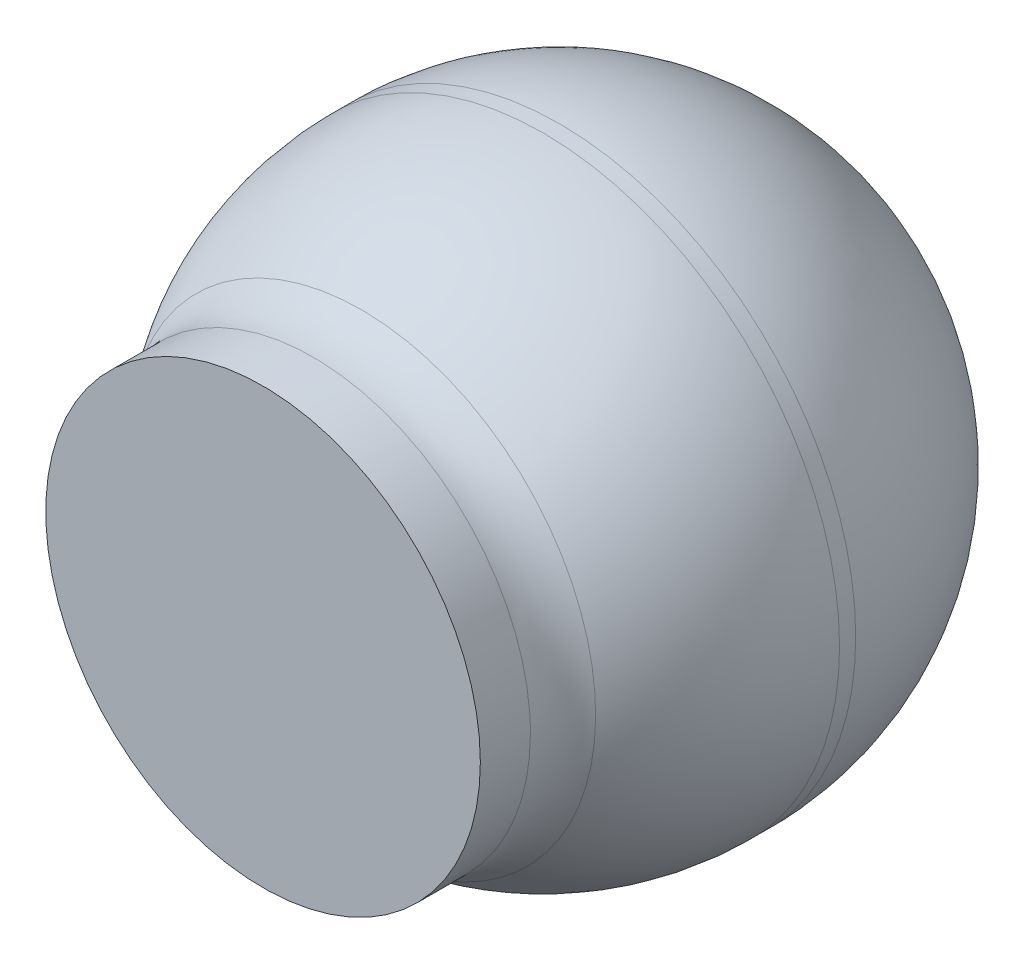
ISO-10303-21;
HEADER;
FILE_DESCRIPTION(('STEP AP214'),'2;1');
FILE_NAME('part.step','',(''),(''),'','','');
FILE_SCHEMA(('AUTOMOTIVE_DESIGN { 1 0 10303 214 1 1 1 1 }'));
ENDSEC;
DATA;
#1=APPLICATION_CONTEXT('core data for automotive mechanical design processes');
#2=APPLICATION_PROTOCOL_DEFINITION('international standard','automotive_design',2000,#1);
#3=PRODUCT_CONTEXT('',#1,'mechanical');
#4=PRODUCT('Part','Part','',(#3));
#5=PRODUCT_RELATED_PRODUCT_CATEGORY('part','',(#4));
#6=PRODUCT_DEFINITION_FORMATION('','',#4);
#7=PRODUCT_DEFINITION_CONTEXT('part definition',#1,'design');
#8=PRODUCT_DEFINITION('design','',#6,#7);
#9=PRODUCT_DEFINITION_SHAPE('','',#8);
#10=(LENGTH_UNIT() NAMED_UNIT(*) SI_UNIT(.MILLI.,.METRE.));
#11=(NAMED_UNIT(*) PLANE_ANGLE_UNIT() SI_UNIT($,.RADIAN.));
#12=(NAMED_UNIT(*) SI_UNIT($,.STERADIAN.) SOLID_ANGLE_UNIT());
#13=UNCERTAINTY_MEASURE_WITH_UNIT(LENGTH_MEASURE(1.E-05),#10,'distance_accuracy_value','');
#14=(GEOMETRIC_REPRESENTATION_CONTEXT(3) GLOBAL_UNCERTAINTY_ASSIGNED_CONTEXT((#13)) GLOBAL_UNIT_ASSIGNED_CONTEXT((#10,
#11,#12)) REPRESENTATION_CONTEXT('',''));
#15=CARTESIAN_POINT('',(0.,0.,0.));
#16=DIRECTION('',(0.,0.,1.));
#17=DIRECTION('',(1.,0.,0.));
#18=AXIS2_PLACEMENT_3D('',#15,#16,#17);
#19=CARTESIAN_POINT('',(0.707080077731,-4.051349291452,10.006534503384));
#20=DIRECTION('',(0.,0.,-1.));
#21=DIRECTION('',(-1.,0.,0.));
#22=AXIS2_PLACEMENT_3D('',#19,#20,#21);
#23=PLANE('',#22);
#24=CARTESIAN_POINT('',(0.707080077731,-4.051349291452,10.006534503384));
#25=DIRECTION('',(0.,0.,1.));
#26=DIRECTION('',(1.,0.,0.));
#27=AXIS2_PLACEMENT_3D('',#24,#25,#26);
#28=CIRCLE('',#27,0.275);
#29=CARTESIAN_POINT('',(0.982080077731,-4.051349291452,10.006534503384));
#30=VERTEX_POINT('',#29);
#31=EDGE_CURVE('E20',#30,#30,#28,.F.);
#32=ORIENTED_EDGE('',*,*,#31,.F.);
#33=EDGE_LOOP('',(#32));
#34=FACE_BOUND('',#33,.T.);
#35=ADVANCED_FACE('F17',(#34),#23,.F.);
#36=CARTESIAN_POINT('',(0.707080077731,-4.051349291452,9.906534503384));
#37=DIRECTION('',(0.,0.,1.));
#38=DIRECTION('',(1.,0.,0.));
#39=AXIS2_PLACEMENT_3D('',#36,#37,#38);
#40=CYLINDRICAL_SURFACE('',#39,0.275);
#41=CARTESIAN_POINT('',(0.707080077731,-4.051349291452,9.943180457728));
#42=DIRECTION('',(0.,0.,-1.));
#43=DIRECTION('',(0.996700902337583,0.0811622527992438,0.));
#44=AXIS2_PLACEMENT_3D('',#41,#42,#43);
#45=CIRCLE('',#44,0.275);
#46=CARTESIAN_POINT('',(0.981172825873835,-4.02902967193221,9.943180457728));
#47=VERTEX_POINT('',#46);
#48=EDGE_CURVE('E65',#47,#47,#45,.F.);
#49=ORIENTED_EDGE('',*,*,#48,.T.);
#50=EDGE_LOOP('',(#49));
#51=FACE_BOUND('',#50,.T.);
#52=ORIENTED_EDGE('',*,*,#31,.T.);
#53=EDGE_LOOP('',(#52));
#54=FACE_BOUND('',#53,.T.);
#55=ADVANCED_FACE('F62',(#51,#54),#40,.T.);
#56=CARTESIAN_POINT('',(0.707080077731,-4.051349291452,9.943180457728));
#57=DIRECTION('',(0.,0.,-1.));
#58=DIRECTION('',(0.996700902337583,0.0811622527992449,0.));
#59=AXIS2_PLACEMENT_3D('',#56,#57,#58);
#60=TOROIDAL_SURFACE('',#59,0.375,0.1);
#61=ORIENTED_EDGE('',*,*,#48,.F.);
#62=EDGE_LOOP('',(#61));
#63=FACE_BOUND('',#62,.T.);
#64=CARTESIAN_POINT('',(0.707080077731001,-4.051349291452,9.881744931236));
#65=DIRECTION('',(0.,0.,-1.));
#66=DIRECTION('',(-0.996700902337598,-0.0811622527990592,0.));
#67=AXIS2_PLACEMENT_3D('',#64,#65,#66);
#68=CIRCLE('',#67,0.296097046412665);
#69=CARTESIAN_POINT('',(0.411959884392,-4.075381194786,9.881744931236));
#70=VERTEX_POINT('',#69);
#71=EDGE_CURVE('E39',#70,#70,#68,.T.);
#72=ORIENTED_EDGE('',*,*,#71,.F.);
#73=EDGE_LOOP('',(#72));
#74=FACE_BOUND('',#73,.T.);
#75=ADVANCED_FACE('F57',(#63,#74),#60,.F.);
#76=CARTESIAN_POINT('',(0.333317239355,-4.081785136252,9.651976062157));
#77=CARTESIAN_POINT('',(0.333317239355,-4.081785136252,9.701461392103));
#78=CARTESIAN_POINT('',(0.341473782652,-4.081120941579,9.750947004335));
#79=CARTESIAN_POINT('',(0.357792914651,-4.079792059952,9.798626332798));
#80=CARTESIAN_POINT('',(0.381658609162,-4.077848654938,9.842699544317));
#81=CARTESIAN_POINT('',(0.411959884392,-4.075381194786,9.881744931236));
#82=(BOUNDED_CURVE() B_SPLINE_CURVE(5,(#76,#77,#78,#79,#80,#81),.UNSPECIFIED.,.F.,
.F.) B_SPLINE_CURVE_WITH_KNOTS((6,6),(0.,0.661568582165),
.UNSPECIFIED.) CURVE() GEOMETRIC_REPRESENTATION_ITEM() RATIONAL_B_SPLINE_CURVE((1.,1.,1.,1.,1.,1.)) REPRESENTATION_ITEM(''));
#83=CARTESIAN_POINT('',(0.707080077731,-4.051349291452,9.651976062157));
#84=DIRECTION('',(0.,0.,-1.));
#85=AXIS1_PLACEMENT('',#83,#84);
#86=SURFACE_OF_REVOLUTION('',#82,#85);
#87=CARTESIAN_POINT('',(0.707080077731001,-4.051349291452,9.651976062157));
#88=DIRECTION('',(0.,0.,1.));
#89=DIRECTION('',(1.,0.,0.));
#90=AXIS2_PLACEMENT_3D('',#87,#88,#89);
#91=CIRCLE('',#90,0.375);
#92=CARTESIAN_POINT('',(1.082080077731,-4.051349291452,9.651976062157));
#93=VERTEX_POINT('',#92);
#94=EDGE_CURVE('E36',#93,#93,#91,.F.);
#95=ORIENTED_EDGE('',*,*,#94,.F.);
#96=EDGE_LOOP('',(#95));
#97=FACE_BOUND('',#96,.T.);
#98=ORIENTED_EDGE('',*,*,#71,.T.);
#99=EDGE_LOOP('',(#98));
#100=FACE_BOUND('',#99,.T.);
#101=ADVANCED_FACE('F53',(#97,#100),#86,.F.);
#102=CARTESIAN_POINT('',(0.707080077731,-4.051349291452,9.256534503384));
#103=DIRECTION('',(0.,0.,1.));
#104=DIRECTION('',(1.,0.,0.));
#105=AXIS2_PLACEMENT_3D('',#102,#103,#104);
#106=CYLINDRICAL_SURFACE('',#105,0.375);
#107=CARTESIAN_POINT('',(0.707080077731,-4.051349291452,9.631534503384));
#108=DIRECTION('',(0.,0.,-1.));
#109=DIRECTION('',(0.0811622527992362,-0.996700902337583,0.));
#110=AXIS2_PLACEMENT_3D('',#107,#108,#109);
#111=CIRCLE('',#110,0.375);
#112=CARTESIAN_POINT('',(0.737515922530713,-4.42511212982859,9.631534503384));
#113=VERTEX_POINT('',#112);
#114=CARTESIAN_POINT('',(0.676644232931287,-3.67758645307541,9.631534503384));
#115=VERTEX_POINT('',#114);
#116=EDGE_CURVE('E11',#113,#115,#111,.T.);
#117=ORIENTED_EDGE('',*,*,#116,.F.);
#118=CARTESIAN_POINT('',(0.707080077731,-4.051349291452,9.631534503384));
#119=DIRECTION('',(0.,0.,1.));
#120=DIRECTION('',(0.0811622527992359,-0.996700902337583,0.));
#121=AXIS2_PLACEMENT_3D('',#118,#119,#120);
#122=CIRCLE('',#121,0.375);
#123=EDGE_CURVE('E25',#115,#113,#122,.F.);
#124=ORIENTED_EDGE('',*,*,#123,.F.);
#125=EDGE_LOOP('',(#117,#124));
#126=FACE_BOUND('',#125,.T.);
#127=ORIENTED_EDGE('',*,*,#94,.T.);
#128=EDGE_LOOP('',(#127));
#129=FACE_BOUND('',#128,.T.);
#130=ADVANCED_FACE('F34',(#126,#129),#106,.T.);
#131=CARTESIAN_POINT('',(0.707080077731,-4.051349291452,9.631534503384));
#132=DIRECTION('',(0.0811622527992361,-0.996700902337583,0.));
#133=DIRECTION('',(-0.996700902337583,-0.0811622527992361,0.));
#134=AXIS2_PLACEMENT_3D('',#131,#132,#133);
#135=SPHERICAL_SURFACE('',#134,0.375);
#136=ORIENTED_EDGE('',*,*,#123,.T.);
#137=ORIENTED_EDGE('',*,*,#116,.T.);
#138=EDGE_LOOP('',(#136,#137));
#139=FACE_BOUND('',#138,.T.);
#140=ADVANCED_FACE('F32',(#139),#135,.T.);
#141=CLOSED_SHELL('',(#35,#55,#75,#101,#130,#140));
#142=MANIFOLD_SOLID_BREP('B1',#141);
#143=ADVANCED_BREP_SHAPE_REPRESENTATION('',(#18,#142),#14);
#144=SHAPE_DEFINITION_REPRESENTATION(#9,#143);
ENDSEC;
END-ISO-10303-21;
